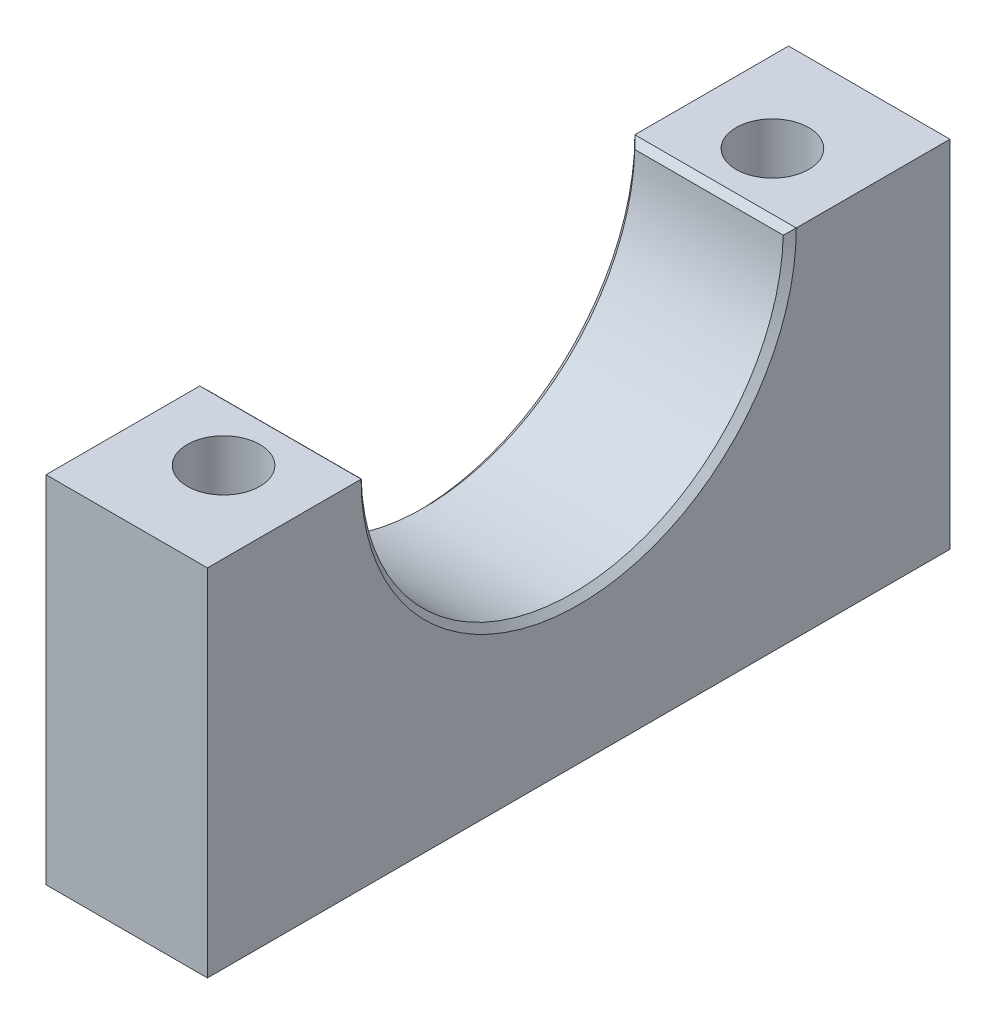
ISO-10303-21;
HEADER;
FILE_DESCRIPTION(('STEP AP214'),'2;1');
FILE_NAME('part.step','',(''),(''),'','','');
FILE_SCHEMA(('AUTOMOTIVE_DESIGN { 1 0 10303 214 1 1 1 1 }'));
ENDSEC;
DATA;
#1=APPLICATION_CONTEXT('core data for automotive mechanical design processes');
#2=APPLICATION_PROTOCOL_DEFINITION('international standard','automotive_design',2000,#1);
#3=PRODUCT_CONTEXT('',#1,'mechanical');
#4=PRODUCT('Part','Part','',(#3));
#5=PRODUCT_RELATED_PRODUCT_CATEGORY('part','',(#4));
#6=PRODUCT_DEFINITION_FORMATION('','',#4);
#7=PRODUCT_DEFINITION_CONTEXT('part definition',#1,'design');
#8=PRODUCT_DEFINITION('design','',#6,#7);
#9=PRODUCT_DEFINITION_SHAPE('','',#8);
#10=(LENGTH_UNIT() NAMED_UNIT(*) SI_UNIT(.MILLI.,.METRE.));
#11=(NAMED_UNIT(*) PLANE_ANGLE_UNIT() SI_UNIT($,.RADIAN.));
#12=(NAMED_UNIT(*) SI_UNIT($,.STERADIAN.) SOLID_ANGLE_UNIT());
#13=UNCERTAINTY_MEASURE_WITH_UNIT(LENGTH_MEASURE(1.E-05),#10,'distance_accuracy_value','');
#14=(GEOMETRIC_REPRESENTATION_CONTEXT(3) GLOBAL_UNCERTAINTY_ASSIGNED_CONTEXT((#13)) GLOBAL_UNIT_ASSIGNED_CONTEXT((#10,
#11,#12)) REPRESENTATION_CONTEXT('',''));
#15=CARTESIAN_POINT('',(0.,0.,0.));
#16=DIRECTION('',(0.,0.,1.));
#17=DIRECTION('',(1.,0.,0.));
#18=AXIS2_PLACEMENT_3D('',#15,#16,#17);
#19=CARTESIAN_POINT('',(15.875,0.,0.));
#20=DIRECTION('',(-1.,0.,0.));
#21=DIRECTION('',(0.,0.,1.));
#22=AXIS2_PLACEMENT_3D('',#19,#20,#21);
#23=CYLINDRICAL_SURFACE('',#22,20.7645);
#24=CARTESIAN_POINT('',(15.24,0.,0.));
#25=DIRECTION('',(1.,0.,0.));
#26=DIRECTION('',(0.,0.,-1.));
#27=AXIS2_PLACEMENT_3D('',#24,#25,#26);
#28=CIRCLE('',#27,20.7645);
#29=CARTESIAN_POINT('',(15.24,-0.616157270029674,20.7553561874662));
#30=VERTEX_POINT('',#29);
#31=CARTESIAN_POINT('',(15.24,-0.616157270029674,-20.7553561874662));
#32=VERTEX_POINT('',#31);
#33=EDGE_CURVE('E181',#30,#32,#28,.T.);
#34=ORIENTED_EDGE('',*,*,#33,.T.);
#35=DIRECTION('',(-1.,0.,0.));
#36=VECTOR('',#35,1.);
#37=CARTESIAN_POINT('',(15.875,-0.616157270029674,-20.7553561874662));
#38=LINE('',#37,#36);
#39=CARTESIAN_POINT('',(0.635,-0.616157270029674,-20.7553561874662));
#40=VERTEX_POINT('',#39);
#41=EDGE_CURVE('E183',#32,#40,#38,.T.);
#42=ORIENTED_EDGE('',*,*,#41,.T.);
#43=CARTESIAN_POINT('',(0.635,0.,0.));
#44=DIRECTION('',(1.,0.,0.));
#45=DIRECTION('',(0.,0.,-1.));
#46=AXIS2_PLACEMENT_3D('',#43,#44,#45);
#47=CIRCLE('',#46,20.7645);
#48=CARTESIAN_POINT('',(0.635,-0.616157270029674,20.7553561874662));
#49=VERTEX_POINT('',#48);
#50=EDGE_CURVE('E139',#40,#49,#47,.F.);
#51=ORIENTED_EDGE('',*,*,#50,.T.);
#52=DIRECTION('',(-1.,0.,0.));
#53=VECTOR('',#52,1.);
#54=CARTESIAN_POINT('',(15.875,-0.616157270029674,20.7553561874662));
#55=LINE('',#54,#53);
#56=EDGE_CURVE('E179',#49,#30,#55,.F.);
#57=ORIENTED_EDGE('',*,*,#56,.T.);
#58=EDGE_LOOP('',(#34,#42,#51,#57));
#59=FACE_BOUND('',#58,.T.);
#60=ADVANCED_FACE('F49',(#59),#23,.F.);
#61=CARTESIAN_POINT('',(15.875,0.,0.));
#62=DIRECTION('',(0.,1.,0.));
#63=DIRECTION('',(0.,0.,1.));
#64=AXIS2_PLACEMENT_3D('',#61,#62,#63);
#65=PLANE('',#64);
#66=CARTESIAN_POINT('',(7.93750000000001,0.,26.9875));
#67=DIRECTION('',(0.,1.,0.));
#68=DIRECTION('',(0.,0.,1.));
#69=AXIS2_PLACEMENT_3D('',#66,#67,#68);
#70=CIRCLE('',#69,3.57123999999999);
#71=CARTESIAN_POINT('',(7.93750000000001,0.,30.55874));
#72=VERTEX_POINT('',#71);
#73=EDGE_CURVE('E276',#72,#72,#70,.T.);
#74=ORIENTED_EDGE('',*,*,#73,.F.);
#75=EDGE_LOOP('',(#74));
#76=FACE_BOUND('',#75,.T.);
#77=DIRECTION('',(0.,0.,-1.));
#78=VECTOR('',#77,1.);
#79=CARTESIAN_POINT('',(15.875,0.,0.));
#80=LINE('',#79,#78);
#81=CARTESIAN_POINT('',(15.875,0.,36.5125));
#82=VERTEX_POINT('',#81);
#83=CARTESIAN_POINT('',(15.875,0.,21.3995));
#84=VERTEX_POINT('',#83);
#85=EDGE_CURVE('E132',#82,#84,#80,.T.);
#86=ORIENTED_EDGE('',*,*,#85,.T.);
#87=DIRECTION('',(0.707106781186549,0.,0.707106781186546));
#88=VECTOR('',#87,1.);
#89=CARTESIAN_POINT('',(-5.52450000000011,0.,0.));
#90=LINE('',#89,#88);
#91=CARTESIAN_POINT('',(15.8655765601715,0.,21.3900765601715));
#92=VERTEX_POINT('',#91);
#93=EDGE_CURVE('E64',#84,#92,#90,.F.);
#94=ORIENTED_EDGE('',*,*,#93,.T.);
#95=DIRECTION('',(-1.,0.,0.));
#96=VECTOR('',#95,1.);
#97=CARTESIAN_POINT('',(15.875,0.,21.3900765601715));
#98=LINE('',#97,#96);
#99=CARTESIAN_POINT('',(0.00942343982845983,0.,21.3900765601715));
#100=VERTEX_POINT('',#99);
#101=EDGE_CURVE('E75',#92,#100,#98,.T.);
#102=ORIENTED_EDGE('',*,*,#101,.T.);
#103=DIRECTION('',(0.707106781186549,0.,-0.707106781186546));
#104=VECTOR('',#103,1.);
#105=CARTESIAN_POINT('',(21.3995000000001,0.,0.));
#106=LINE('',#105,#104);
#107=CARTESIAN_POINT('',(0.,0.,21.3995));
#108=VERTEX_POINT('',#107);
#109=EDGE_CURVE('E194',#100,#108,#106,.F.);
#110=ORIENTED_EDGE('',*,*,#109,.T.);
#111=DIRECTION('',(0.,0.,-1.));
#112=VECTOR('',#111,1.);
#113=CARTESIAN_POINT('',(0.,0.,0.));
#114=LINE('',#113,#112);
#115=CARTESIAN_POINT('',(0.,0.,36.5125));
#116=VERTEX_POINT('',#115);
#117=EDGE_CURVE('E134',#116,#108,#114,.T.);
#118=ORIENTED_EDGE('',*,*,#117,.F.);
#119=DIRECTION('',(-1.,0.,0.));
#120=VECTOR('',#119,1.);
#121=CARTESIAN_POINT('',(15.875,0.,36.5125));
#122=LINE('',#121,#120);
#123=EDGE_CURVE('E129',#82,#116,#122,.T.);
#124=ORIENTED_EDGE('',*,*,#123,.F.);
#125=EDGE_LOOP('',(#86,#94,#102,#110,#118,#124));
#126=FACE_BOUND('',#125,.T.);
#127=ADVANCED_FACE('F131',(#76,#126),#65,.T.);
#128=CARTESIAN_POINT('',(15.875,0.,36.5125));
#129=DIRECTION('',(0.,0.,1.));
#130=DIRECTION('',(1.,0.,0.));
#131=AXIS2_PLACEMENT_3D('',#128,#129,#130);
#132=PLANE('',#131);
#133=DIRECTION('',(0.,1.,0.));
#134=VECTOR('',#133,1.);
#135=CARTESIAN_POINT('',(0.,0.,36.5125));
#136=LINE('',#135,#134);
#137=CARTESIAN_POINT('',(0.,-34.925,36.5125));
#138=VERTEX_POINT('',#137);
#139=EDGE_CURVE('E163',#138,#116,#136,.T.);
#140=ORIENTED_EDGE('',*,*,#139,.F.);
#141=DIRECTION('',(-1.,0.,0.));
#142=VECTOR('',#141,1.);
#143=CARTESIAN_POINT('',(15.875,-34.925,36.5125));
#144=LINE('',#143,#142);
#145=CARTESIAN_POINT('',(15.875,-34.925,36.5125));
#146=VERTEX_POINT('',#145);
#147=EDGE_CURVE('E140',#146,#138,#144,.T.);
#148=ORIENTED_EDGE('',*,*,#147,.F.);
#149=DIRECTION('',(0.,1.,0.));
#150=VECTOR('',#149,1.);
#151=CARTESIAN_POINT('',(15.875,0.,36.5125));
#152=LINE('',#151,#150);
#153=EDGE_CURVE('E146',#146,#82,#152,.T.);
#154=ORIENTED_EDGE('',*,*,#153,.T.);
#155=ORIENTED_EDGE('',*,*,#123,.T.);
#156=EDGE_LOOP('',(#140,#148,#154,#155));
#157=FACE_BOUND('',#156,.T.);
#158=ADVANCED_FACE('F152',(#157),#132,.T.);
#159=CARTESIAN_POINT('',(15.875,-34.925,0.));
#160=DIRECTION('',(0.,1.,0.));
#161=DIRECTION('',(0.,0.,1.));
#162=AXIS2_PLACEMENT_3D('',#159,#160,#161);
#163=PLANE('',#162);
#164=CARTESIAN_POINT('',(7.93750000000001,-34.925,26.9875));
#165=DIRECTION('',(0.,1.,0.));
#166=DIRECTION('',(0.,0.,1.));
#167=AXIS2_PLACEMENT_3D('',#164,#165,#166);
#168=CIRCLE('',#167,3.57123999999998);
#169=CARTESIAN_POINT('',(7.93750000000001,-34.925,30.55874));
#170=VERTEX_POINT('',#169);
#171=EDGE_CURVE('E279',#170,#170,#168,.T.);
#172=ORIENTED_EDGE('',*,*,#171,.T.);
#173=EDGE_LOOP('',(#172));
#174=FACE_BOUND('',#173,.T.);
#175=CARTESIAN_POINT('',(7.9375,-34.925,-26.9875));
#176=DIRECTION('',(0.,1.,0.));
#177=DIRECTION('',(0.,0.,1.));
#178=AXIS2_PLACEMENT_3D('',#175,#176,#177);
#179=CIRCLE('',#178,3.57123999999998);
#180=CARTESIAN_POINT('',(7.9375,-34.925,-23.41626));
#181=VERTEX_POINT('',#180);
#182=EDGE_CURVE('E281',#181,#181,#179,.T.);
#183=ORIENTED_EDGE('',*,*,#182,.T.);
#184=EDGE_LOOP('',(#183));
#185=FACE_BOUND('',#184,.T.);
#186=DIRECTION('',(0.,0.,-1.));
#187=VECTOR('',#186,1.);
#188=CARTESIAN_POINT('',(0.,-34.925,0.));
#189=LINE('',#188,#187);
#190=CARTESIAN_POINT('',(0.,-34.925,-36.5125));
#191=VERTEX_POINT('',#190);
#192=EDGE_CURVE('E166',#138,#191,#189,.T.);
#193=ORIENTED_EDGE('',*,*,#192,.T.);
#194=DIRECTION('',(-1.,0.,0.));
#195=VECTOR('',#194,1.);
#196=CARTESIAN_POINT('',(15.875,-34.925,-36.5125));
#197=LINE('',#196,#195);
#198=CARTESIAN_POINT('',(15.875,-34.925,-36.5125));
#199=VERTEX_POINT('',#198);
#200=EDGE_CURVE('E174',#199,#191,#197,.T.);
#201=ORIENTED_EDGE('',*,*,#200,.F.);
#202=DIRECTION('',(0.,0.,-1.));
#203=VECTOR('',#202,1.);
#204=CARTESIAN_POINT('',(15.875,-34.925,0.));
#205=LINE('',#204,#203);
#206=EDGE_CURVE('E154',#146,#199,#205,.T.);
#207=ORIENTED_EDGE('',*,*,#206,.F.);
#208=ORIENTED_EDGE('',*,*,#147,.T.);
#209=EDGE_LOOP('',(#193,#201,#207,#208));
#210=FACE_BOUND('',#209,.T.);
#211=ADVANCED_FACE('F250',(#174,#185,#210),#163,.F.);
#212=CARTESIAN_POINT('',(15.875,0.,-36.5125));
#213=DIRECTION('',(0.,0.,1.));
#214=DIRECTION('',(1.,0.,0.));
#215=AXIS2_PLACEMENT_3D('',#212,#213,#214);
#216=PLANE('',#215);
#217=DIRECTION('',(0.,1.,0.));
#218=VECTOR('',#217,1.);
#219=CARTESIAN_POINT('',(0.,0.,-36.5125));
#220=LINE('',#219,#218);
#221=CARTESIAN_POINT('',(0.,0.,-36.5125));
#222=VERTEX_POINT('',#221);
#223=EDGE_CURVE('E168',#191,#222,#220,.T.);
#224=ORIENTED_EDGE('',*,*,#223,.T.);
#225=DIRECTION('',(-1.,0.,0.));
#226=VECTOR('',#225,1.);
#227=CARTESIAN_POINT('',(15.875,0.,-36.5125));
#228=LINE('',#227,#226);
#229=CARTESIAN_POINT('',(15.875,0.,-36.5125));
#230=VERTEX_POINT('',#229);
#231=EDGE_CURVE('E171',#230,#222,#228,.T.);
#232=ORIENTED_EDGE('',*,*,#231,.F.);
#233=DIRECTION('',(0.,1.,0.));
#234=VECTOR('',#233,1.);
#235=CARTESIAN_POINT('',(15.875,0.,-36.5125));
#236=LINE('',#235,#234);
#237=EDGE_CURVE('E156',#199,#230,#236,.T.);
#238=ORIENTED_EDGE('',*,*,#237,.F.);
#239=ORIENTED_EDGE('',*,*,#200,.T.);
#240=EDGE_LOOP('',(#224,#232,#238,#239));
#241=FACE_BOUND('',#240,.T.);
#242=ADVANCED_FACE('F253',(#241),#216,.F.);
#243=CARTESIAN_POINT('',(7.9375,0.,-26.9875));
#244=DIRECTION('',(0.,1.,0.));
#245=DIRECTION('',(0.,0.,1.));
#246=AXIS2_PLACEMENT_3D('',#243,#244,#245);
#247=CIRCLE('',#246,3.57123999999999);
#248=CARTESIAN_POINT('',(7.9375,0.,-23.41626));
#249=VERTEX_POINT('',#248);
#250=EDGE_CURVE('E164',#249,#249,#247,.T.);
#251=ORIENTED_EDGE('',*,*,#250,.F.);
#252=EDGE_LOOP('',(#251));
#253=FACE_BOUND('',#252,.T.);
#254=DIRECTION('',(1.,0.,0.));
#255=VECTOR('',#254,1.);
#256=CARTESIAN_POINT('',(15.875,0.,-21.3900765601715));
#257=LINE('',#256,#255);
#258=CARTESIAN_POINT('',(0.00942343982845983,0.,-21.3900765601715));
#259=VERTEX_POINT('',#258);
#260=CARTESIAN_POINT('',(15.8655765601715,0.,-21.3900765601715));
#261=VERTEX_POINT('',#260);
#262=EDGE_CURVE('E188',#259,#261,#257,.T.);
#263=ORIENTED_EDGE('',*,*,#262,.T.);
#264=DIRECTION('',(-0.707106781186549,0.,0.707106781186546));
#265=VECTOR('',#264,1.);
#266=CARTESIAN_POINT('',(-5.52450000000011,0.,0.));
#267=LINE('',#266,#265);
#268=CARTESIAN_POINT('',(15.875,0.,-21.3995));
#269=VERTEX_POINT('',#268);
#270=EDGE_CURVE('E191',#261,#269,#267,.F.);
#271=ORIENTED_EDGE('',*,*,#270,.T.);
#272=EDGE_CURVE('E151',#269,#230,#80,.T.);
#273=ORIENTED_EDGE('',*,*,#272,.T.);
#274=ORIENTED_EDGE('',*,*,#231,.T.);
#275=CARTESIAN_POINT('',(0.,0.,-21.3995));
#276=VERTEX_POINT('',#275);
#277=EDGE_CURVE('E149',#276,#222,#114,.T.);
#278=ORIENTED_EDGE('',*,*,#277,.F.);
#279=DIRECTION('',(-0.707106781186549,0.,-0.707106781186546));
#280=VECTOR('',#279,1.);
#281=CARTESIAN_POINT('',(21.3995000000001,0.,0.));
#282=LINE('',#281,#280);
#283=EDGE_CURVE('E186',#276,#259,#282,.F.);
#284=ORIENTED_EDGE('',*,*,#283,.T.);
#285=EDGE_LOOP('',(#263,#271,#273,#274,#278,#284));
#286=FACE_BOUND('',#285,.T.);
#287=ADVANCED_FACE('F246',(#253,#286),#65,.T.);
#288=CARTESIAN_POINT('',(15.875,0.,0.));
#289=DIRECTION('',(1.,0.,0.));
#290=DIRECTION('',(0.,0.,-1.));
#291=AXIS2_PLACEMENT_3D('',#288,#289,#290);
#292=PLANE('',#291);
#293=ORIENTED_EDGE('',*,*,#272,.F.);
#294=CARTESIAN_POINT('',(15.875,0.,0.));
#295=DIRECTION('',(1.,0.,0.));
#296=DIRECTION('',(0.,0.,-1.));
#297=AXIS2_PLACEMENT_3D('',#294,#295,#296);
#298=CIRCLE('',#297,21.3995);
#299=EDGE_CURVE('E148',#269,#84,#298,.F.);
#300=ORIENTED_EDGE('',*,*,#299,.T.);
#301=ORIENTED_EDGE('',*,*,#85,.F.);
#302=ORIENTED_EDGE('',*,*,#153,.F.);
#303=ORIENTED_EDGE('',*,*,#206,.T.);
#304=ORIENTED_EDGE('',*,*,#237,.T.);
#305=EDGE_LOOP('',(#293,#300,#301,#302,#303,#304));
#306=FACE_BOUND('',#305,.T.);
#307=ADVANCED_FACE('F145',(#306),#292,.T.);
#308=CARTESIAN_POINT('',(0.,0.,0.));
#309=DIRECTION('',(1.,0.,0.));
#310=DIRECTION('',(0.,0.,-1.));
#311=AXIS2_PLACEMENT_3D('',#308,#309,#310);
#312=PLANE('',#311);
#313=ORIENTED_EDGE('',*,*,#117,.T.);
#314=CARTESIAN_POINT('',(0.,0.,0.));
#315=DIRECTION('',(1.,0.,0.));
#316=DIRECTION('',(0.,0.,-1.));
#317=AXIS2_PLACEMENT_3D('',#314,#315,#316);
#318=CIRCLE('',#317,21.3995);
#319=EDGE_CURVE('E12',#108,#276,#318,.T.);
#320=ORIENTED_EDGE('',*,*,#319,.T.);
#321=ORIENTED_EDGE('',*,*,#277,.T.);
#322=ORIENTED_EDGE('',*,*,#223,.F.);
#323=ORIENTED_EDGE('',*,*,#192,.F.);
#324=ORIENTED_EDGE('',*,*,#139,.T.);
#325=EDGE_LOOP('',(#313,#320,#321,#322,#323,#324));
#326=FACE_BOUND('',#325,.T.);
#327=ADVANCED_FACE('F260',(#326),#312,.F.);
#328=CARTESIAN_POINT('',(7.9375,34.925,-26.9875));
#329=DIRECTION('',(0.,1.,0.));
#330=DIRECTION('',(0.,0.,1.));
#331=AXIS2_PLACEMENT_3D('',#328,#329,#330);
#332=CYLINDRICAL_SURFACE('',#331,3.57123999999999);
#333=ORIENTED_EDGE('',*,*,#250,.T.);
#334=EDGE_LOOP('',(#333));
#335=FACE_BOUND('',#334,.T.);
#336=ORIENTED_EDGE('',*,*,#182,.F.);
#337=EDGE_LOOP('',(#336));
#338=FACE_BOUND('',#337,.T.);
#339=ADVANCED_FACE('F263',(#335,#338),#332,.F.);
#340=CARTESIAN_POINT('',(7.93750000000001,34.925,26.9875));
#341=DIRECTION('',(0.,1.,0.));
#342=DIRECTION('',(0.,0.,1.));
#343=AXIS2_PLACEMENT_3D('',#340,#341,#342);
#344=CYLINDRICAL_SURFACE('',#343,3.57123999999999);
#345=ORIENTED_EDGE('',*,*,#73,.T.);
#346=EDGE_LOOP('',(#345));
#347=FACE_BOUND('',#346,.T.);
#348=ORIENTED_EDGE('',*,*,#171,.F.);
#349=EDGE_LOOP('',(#348));
#350=FACE_BOUND('',#349,.T.);
#351=ADVANCED_FACE('F236',(#347,#350),#344,.F.);
#352=CARTESIAN_POINT('',(15.875,0.,21.3900765601715));
#353=DIRECTION('',(0.,-0.717521285574318,0.696536578183643));
#354=DIRECTION('',(-1.,0.,0.));
#355=AXIS2_PLACEMENT_3D('',#352,#353,#354);
#356=PLANE('',#355);
#357=CARTESIAN_POINT('',(0.00942343982845988,0.,21.3900765601715));
#358=CARTESIAN_POINT('',(0.11471717403378,-0.102185013158632,21.2848129971305));
#359=CARTESIAN_POINT('',(0.219495411785424,-0.204623949544592,21.1792878608625));
#360=CARTESIAN_POINT('',(0.428020932216735,-0.410009706036861,20.9677144034838));
#361=CARTESIAN_POINT('',(0.531768214522272,-0.512956526327459,20.8616660821834));
#362=CARTESIAN_POINT('',(0.634999999999999,-0.616157270029674,20.7553561874662));
#363=B_SPLINE_CURVE_WITH_KNOTS('',3,(#357,#358,#359,#360,#361,#362),.UNSPECIFIED.,.F.,.F.,(4,2,
4),(0.,0.541728642963967,1.0834574825131),.UNSPECIFIED.);
#364=EDGE_CURVE('E284',#100,#49,#363,.T.);
#365=ORIENTED_EDGE('',*,*,#364,.F.);
#366=ORIENTED_EDGE('',*,*,#101,.F.);
#367=CARTESIAN_POINT('',(15.8655765601715,0.,21.3900765601715));
#368=CARTESIAN_POINT('',(15.7602828259662,-0.102185013158632,21.2848129971305));
#369=CARTESIAN_POINT('',(15.6555045882146,-0.204623949544592,21.1792878608625));
#370=CARTESIAN_POINT('',(15.4469790677833,-0.41000970603686,20.9677144034838));
#371=CARTESIAN_POINT('',(15.3432317854777,-0.512956526327458,20.8616660821834));
#372=CARTESIAN_POINT('',(15.24,-0.616157270029674,20.7553561874662));
#373=B_SPLINE_CURVE_WITH_KNOTS('',3,(#367,#368,#369,#370,#371,#372),.UNSPECIFIED.,.F.,.F.,(4,2,
4),(0.,0.541728642963967,1.0834574825131),.UNSPECIFIED.);
#374=EDGE_CURVE('E55',#30,#92,#373,.F.);
#375=ORIENTED_EDGE('',*,*,#374,.F.);
#376=ORIENTED_EDGE('',*,*,#56,.F.);
#377=EDGE_LOOP('',(#365,#366,#375,#376));
#378=FACE_BOUND('',#377,.T.);
#379=ADVANCED_FACE('F52',(#378),#356,.F.);
#380=CARTESIAN_POINT('',(15.24,0.,0.));
#381=DIRECTION('',(1.,0.,0.));
#382=DIRECTION('',(0.,0.,-1.));
#383=AXIS2_PLACEMENT_3D('',#380,#381,#382);
#384=CONICAL_SURFACE('',#383,20.7645,0.785398163397446);
#385=ORIENTED_EDGE('',*,*,#299,.F.);
#386=ORIENTED_EDGE('',*,*,#270,.F.);
#387=CARTESIAN_POINT('',(15.8655765601715,0.,-21.3900765601715));
#388=CARTESIAN_POINT('',(15.7602828259662,-0.102185013158632,-21.2848129971305));
#389=CARTESIAN_POINT('',(15.6555045882146,-0.204623949544592,-21.1792878608625));
#390=CARTESIAN_POINT('',(15.4469790677833,-0.41000970603686,-20.9677144034838));
#391=CARTESIAN_POINT('',(15.3432317854777,-0.512956526327458,-20.8616660821834));
#392=CARTESIAN_POINT('',(15.24,-0.616157270029674,-20.7553561874662));
#393=B_SPLINE_CURVE_WITH_KNOTS('',3,(#387,#388,#389,#390,#391,#392),.UNSPECIFIED.,.F.,.F.,(4,2,
4),(0.,0.541728642963967,1.0834574825131),.UNSPECIFIED.);
#394=EDGE_CURVE('E206',#32,#261,#393,.F.);
#395=ORIENTED_EDGE('',*,*,#394,.F.);
#396=ORIENTED_EDGE('',*,*,#33,.F.);
#397=ORIENTED_EDGE('',*,*,#374,.T.);
#398=ORIENTED_EDGE('',*,*,#93,.F.);
#399=EDGE_LOOP('',(#385,#386,#395,#396,#397,#398));
#400=FACE_BOUND('',#399,.T.);
#401=ADVANCED_FACE('F223',(#400),#384,.F.);
#402=CARTESIAN_POINT('',(0.,0.,0.));
#403=DIRECTION('',(-1.,0.,0.));
#404=DIRECTION('',(0.,0.,1.));
#405=AXIS2_PLACEMENT_3D('',#402,#403,#404);
#406=CONICAL_SURFACE('',#405,21.3995,0.785398163397446);
#407=ORIENTED_EDGE('',*,*,#364,.T.);
#408=ORIENTED_EDGE('',*,*,#50,.F.);
#409=CARTESIAN_POINT('',(0.635,-0.616157270029674,-20.7553561874662));
#410=CARTESIAN_POINT('',(0.531768214522272,-0.512956526327459,-20.8616660821834));
#411=CARTESIAN_POINT('',(0.428020932216736,-0.410009706036861,-20.9677144034838));
#412=CARTESIAN_POINT('',(0.219495411785424,-0.204623949544593,-21.1792878608625));
#413=CARTESIAN_POINT('',(0.114717174033781,-0.102185013158633,-21.2848129971305));
#414=CARTESIAN_POINT('',(0.00942343982846037,0.,-21.3900765601715));
#415=B_SPLINE_CURVE_WITH_KNOTS('',3,(#409,#410,#411,#412,#413,#414),.UNSPECIFIED.,.F.,.F.,(4,2,
4),(0.,0.541728839549137,1.0834574825131),.UNSPECIFIED.);
#416=EDGE_CURVE('E198',#259,#40,#415,.F.);
#417=ORIENTED_EDGE('',*,*,#416,.F.);
#418=ORIENTED_EDGE('',*,*,#283,.F.);
#419=ORIENTED_EDGE('',*,*,#319,.F.);
#420=ORIENTED_EDGE('',*,*,#109,.F.);
#421=EDGE_LOOP('',(#407,#408,#417,#418,#419,#420));
#422=FACE_BOUND('',#421,.T.);
#423=ADVANCED_FACE('F212',(#422),#406,.F.);
#424=CARTESIAN_POINT('',(15.875,-0.616157270029674,-20.7553561874662));
#425=DIRECTION('',(0.,-0.717521285574318,-0.696536578183643));
#426=DIRECTION('',(-1.,0.,0.));
#427=AXIS2_PLACEMENT_3D('',#424,#425,#426);
#428=PLANE('',#427);
#429=ORIENTED_EDGE('',*,*,#394,.T.);
#430=ORIENTED_EDGE('',*,*,#262,.F.);
#431=ORIENTED_EDGE('',*,*,#416,.T.);
#432=ORIENTED_EDGE('',*,*,#41,.F.);
#433=EDGE_LOOP('',(#429,#430,#431,#432));
#434=FACE_BOUND('',#433,.T.);
#435=ADVANCED_FACE('F216',(#434),#428,.F.);
#436=CLOSED_SHELL('',(#60,#127,#158,#211,#242,#287,#307,#327,#339,#351,#379,#401,#423,#435));
#437=MANIFOLD_SOLID_BREP('B2',#436);
#438=ADVANCED_BREP_SHAPE_REPRESENTATION('',(#18,#437),#14);
#439=SHAPE_DEFINITION_REPRESENTATION(#9,#438);
ENDSEC;
END-ISO-10303-21;
